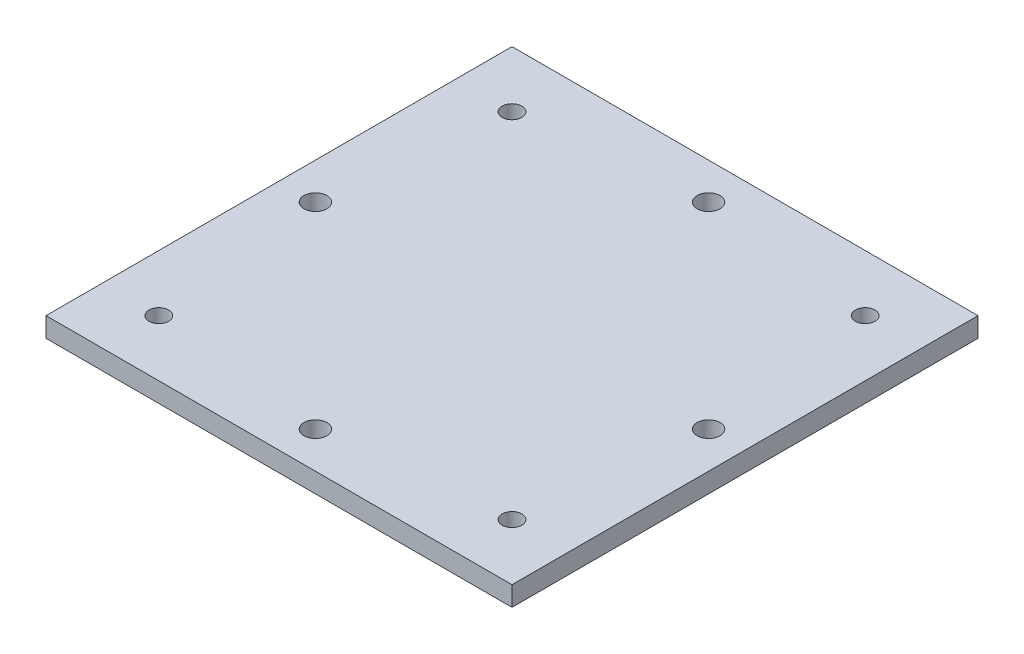
ISO-10303-21;
HEADER;
FILE_DESCRIPTION(('STEP AP214'),'2;1');
FILE_NAME('part.step','',(''),(''),'','','');
FILE_SCHEMA(('AUTOMOTIVE_DESIGN { 1 0 10303 214 1 1 1 1 }'));
ENDSEC;
DATA;
#1=APPLICATION_CONTEXT('core data for automotive mechanical design processes');
#2=APPLICATION_PROTOCOL_DEFINITION('international standard','automotive_design',2000,#1);
#3=PRODUCT_CONTEXT('',#1,'mechanical');
#4=PRODUCT('Part','Part','',(#3));
#5=PRODUCT_RELATED_PRODUCT_CATEGORY('part','',(#4));
#6=PRODUCT_DEFINITION_FORMATION('','',#4);
#7=PRODUCT_DEFINITION_CONTEXT('part definition',#1,'design');
#8=PRODUCT_DEFINITION('design','',#6,#7);
#9=PRODUCT_DEFINITION_SHAPE('','',#8);
#10=(LENGTH_UNIT() NAMED_UNIT(*) SI_UNIT(.MILLI.,.METRE.));
#11=(NAMED_UNIT(*) PLANE_ANGLE_UNIT() SI_UNIT($,.RADIAN.));
#12=(NAMED_UNIT(*) SI_UNIT($,.STERADIAN.) SOLID_ANGLE_UNIT());
#13=UNCERTAINTY_MEASURE_WITH_UNIT(LENGTH_MEASURE(1.E-05),#10,'distance_accuracy_value','');
#14=(GEOMETRIC_REPRESENTATION_CONTEXT(3) GLOBAL_UNCERTAINTY_ASSIGNED_CONTEXT((#13)) GLOBAL_UNIT_ASSIGNED_CONTEXT((#10,
#11,#12)) REPRESENTATION_CONTEXT('',''));
#15=CARTESIAN_POINT('',(0.,0.,0.));
#16=DIRECTION('',(0.,0.,1.));
#17=DIRECTION('',(1.,0.,0.));
#18=AXIS2_PLACEMENT_3D('',#15,#16,#17);
#19=CARTESIAN_POINT('',(0.,3.,0.));
#20=DIRECTION('',(0.,1.,0.));
#21=DIRECTION('',(0.,0.,1.));
#22=AXIS2_PLACEMENT_3D('',#19,#20,#21);
#23=PLANE('',#22);
#24=CARTESIAN_POINT('',(26.9494,3.,26.9494));
#25=DIRECTION('',(0.,1.,0.));
#26=DIRECTION('',(0.,0.,1.));
#27=AXIS2_PLACEMENT_3D('',#24,#25,#26);
#28=CIRCLE('',#27,1.500000048);
#29=CARTESIAN_POINT('',(26.9494,3.,28.449400048));
#30=VERTEX_POINT('',#29);
#31=EDGE_CURVE('E144',#30,#30,#28,.T.);
#32=ORIENTED_EDGE('',*,*,#31,.F.);
#33=EDGE_LOOP('',(#32));
#34=FACE_BOUND('',#33,.T.);
#35=CARTESIAN_POINT('',(0.,3.,30.));
#36=DIRECTION('',(0.,1.,0.));
#37=DIRECTION('',(0.,0.,1.));
#38=AXIS2_PLACEMENT_3D('',#35,#36,#37);
#39=CIRCLE('',#38,1.75259999999999);
#40=CARTESIAN_POINT('',(0.,3.,31.7526));
#41=VERTEX_POINT('',#40);
#42=EDGE_CURVE('E132',#41,#41,#39,.T.);
#43=ORIENTED_EDGE('',*,*,#42,.F.);
#44=EDGE_LOOP('',(#43));
#45=FACE_BOUND('',#44,.T.);
#46=CARTESIAN_POINT('',(-30.,3.,0.));
#47=DIRECTION('',(0.,1.,0.));
#48=DIRECTION('',(0.,0.,1.));
#49=AXIS2_PLACEMENT_3D('',#46,#47,#48);
#50=CIRCLE('',#49,1.75259999999999);
#51=CARTESIAN_POINT('',(-30.,3.,1.75259999999998));
#52=VERTEX_POINT('',#51);
#53=EDGE_CURVE('E120',#52,#52,#50,.T.);
#54=ORIENTED_EDGE('',*,*,#53,.F.);
#55=EDGE_LOOP('',(#54));
#56=FACE_BOUND('',#55,.T.);
#57=CARTESIAN_POINT('',(0.,3.,-30.));
#58=DIRECTION('',(0.,1.,0.));
#59=DIRECTION('',(0.,0.,1.));
#60=AXIS2_PLACEMENT_3D('',#57,#58,#59);
#61=CIRCLE('',#60,1.75259999999999);
#62=CARTESIAN_POINT('',(0.,3.,-28.2474));
#63=VERTEX_POINT('',#62);
#64=EDGE_CURVE('E99',#63,#63,#61,.T.);
#65=ORIENTED_EDGE('',*,*,#64,.F.);
#66=EDGE_LOOP('',(#65));
#67=FACE_BOUND('',#66,.T.);
#68=DIRECTION('',(0.,0.,1.));
#69=VECTOR('',#68,1.);
#70=CARTESIAN_POINT('',(-35.56,3.,35.56));
#71=LINE('',#70,#69);
#72=CARTESIAN_POINT('',(-35.56,3.,-35.56));
#73=VERTEX_POINT('',#72);
#74=CARTESIAN_POINT('',(-35.56,3.,35.56));
#75=VERTEX_POINT('',#74);
#76=EDGE_CURVE('E84',#73,#75,#71,.T.);
#77=ORIENTED_EDGE('',*,*,#76,.T.);
#78=DIRECTION('',(1.,0.,0.));
#79=VECTOR('',#78,1.);
#80=CARTESIAN_POINT('',(35.56,3.,35.56));
#81=LINE('',#80,#79);
#82=CARTESIAN_POINT('',(35.56,3.,35.56));
#83=VERTEX_POINT('',#82);
#84=EDGE_CURVE('E79',#75,#83,#81,.T.);
#85=ORIENTED_EDGE('',*,*,#84,.T.);
#86=DIRECTION('',(0.,0.,-1.));
#87=VECTOR('',#86,1.);
#88=CARTESIAN_POINT('',(35.56,3.,35.56));
#89=LINE('',#88,#87);
#90=CARTESIAN_POINT('',(35.56,3.,-35.56));
#91=VERTEX_POINT('',#90);
#92=EDGE_CURVE('E82',#83,#91,#89,.T.);
#93=ORIENTED_EDGE('',*,*,#92,.T.);
#94=DIRECTION('',(-1.,0.,0.));
#95=VECTOR('',#94,1.);
#96=CARTESIAN_POINT('',(35.56,3.,-35.56));
#97=LINE('',#96,#95);
#98=EDGE_CURVE('E49',#91,#73,#97,.T.);
#99=ORIENTED_EDGE('',*,*,#98,.T.);
#100=EDGE_LOOP('',(#77,#85,#93,#99));
#101=FACE_BOUND('',#100,.T.);
#102=CARTESIAN_POINT('',(26.9494,3.,-26.9494));
#103=DIRECTION('',(0.,1.,0.));
#104=DIRECTION('',(0.,0.,1.));
#105=AXIS2_PLACEMENT_3D('',#102,#103,#104);
#106=CIRCLE('',#105,1.500000048);
#107=CARTESIAN_POINT('',(26.9494,3.,-25.449399952));
#108=VERTEX_POINT('',#107);
#109=EDGE_CURVE('E114',#108,#108,#106,.T.);
#110=ORIENTED_EDGE('',*,*,#109,.F.);
#111=EDGE_LOOP('',(#110));
#112=FACE_BOUND('',#111,.T.);
#113=CARTESIAN_POINT('',(30.,3.,0.));
#114=DIRECTION('',(0.,1.,0.));
#115=DIRECTION('',(0.,0.,1.));
#116=AXIS2_PLACEMENT_3D('',#113,#114,#115);
#117=CIRCLE('',#116,1.75260000000003);
#118=CARTESIAN_POINT('',(30.,3.,1.75260000000002));
#119=VERTEX_POINT('',#118);
#120=EDGE_CURVE('E126',#119,#119,#117,.T.);
#121=ORIENTED_EDGE('',*,*,#120,.F.);
#122=EDGE_LOOP('',(#121));
#123=FACE_BOUND('',#122,.T.);
#124=CARTESIAN_POINT('',(-26.9494,3.,-26.9494));
#125=DIRECTION('',(0.,1.,0.));
#126=DIRECTION('',(0.,0.,1.));
#127=AXIS2_PLACEMENT_3D('',#124,#125,#126);
#128=CIRCLE('',#127,1.500000048);
#129=CARTESIAN_POINT('',(-26.9494,3.,-25.449399952));
#130=VERTEX_POINT('',#129);
#131=EDGE_CURVE('E138',#130,#130,#128,.T.);
#132=ORIENTED_EDGE('',*,*,#131,.F.);
#133=EDGE_LOOP('',(#132));
#134=FACE_BOUND('',#133,.T.);
#135=CARTESIAN_POINT('',(-26.9494,3.,26.9494));
#136=DIRECTION('',(0.,1.,0.));
#137=DIRECTION('',(0.,0.,1.));
#138=AXIS2_PLACEMENT_3D('',#135,#136,#137);
#139=CIRCLE('',#138,1.500000048);
#140=CARTESIAN_POINT('',(-26.9494,3.,28.449400048));
#141=VERTEX_POINT('',#140);
#142=EDGE_CURVE('E150',#141,#141,#139,.T.);
#143=ORIENTED_EDGE('',*,*,#142,.F.);
#144=EDGE_LOOP('',(#143));
#145=FACE_BOUND('',#144,.T.);
#146=ADVANCED_FACE('F32',(#34,#45,#56,#67,#101,#112,#123,#134,#145),#23,.T.);
#147=CARTESIAN_POINT('',(0.,0.,0.));
#148=DIRECTION('',(0.,1.,0.));
#149=DIRECTION('',(0.,0.,1.));
#150=AXIS2_PLACEMENT_3D('',#147,#148,#149);
#151=PLANE('',#150);
#152=DIRECTION('',(0.,0.,1.));
#153=VECTOR('',#152,1.);
#154=CARTESIAN_POINT('',(-35.56,0.,35.56));
#155=LINE('',#154,#153);
#156=CARTESIAN_POINT('',(-35.56,0.,-35.56));
#157=VERTEX_POINT('',#156);
#158=CARTESIAN_POINT('',(-35.56,0.,35.56));
#159=VERTEX_POINT('',#158);
#160=EDGE_CURVE('E96',#157,#159,#155,.T.);
#161=ORIENTED_EDGE('',*,*,#160,.F.);
#162=DIRECTION('',(-1.,0.,0.));
#163=VECTOR('',#162,1.);
#164=CARTESIAN_POINT('',(35.56,0.,-35.56));
#165=LINE('',#164,#163);
#166=CARTESIAN_POINT('',(35.56,0.,-35.56));
#167=VERTEX_POINT('',#166);
#168=EDGE_CURVE('E72',#167,#157,#165,.T.);
#169=ORIENTED_EDGE('',*,*,#168,.F.);
#170=DIRECTION('',(0.,0.,-1.));
#171=VECTOR('',#170,1.);
#172=CARTESIAN_POINT('',(35.56,0.,35.56));
#173=LINE('',#172,#171);
#174=CARTESIAN_POINT('',(35.56,0.,35.56));
#175=VERTEX_POINT('',#174);
#176=EDGE_CURVE('E66',#175,#167,#173,.T.);
#177=ORIENTED_EDGE('',*,*,#176,.F.);
#178=DIRECTION('',(1.,0.,0.));
#179=VECTOR('',#178,1.);
#180=CARTESIAN_POINT('',(35.56,0.,35.56));
#181=LINE('',#180,#179);
#182=EDGE_CURVE('E88',#159,#175,#181,.T.);
#183=ORIENTED_EDGE('',*,*,#182,.F.);
#184=EDGE_LOOP('',(#161,#169,#177,#183));
#185=FACE_BOUND('',#184,.T.);
#186=CARTESIAN_POINT('',(0.,0.,-30.));
#187=DIRECTION('',(0.,1.,0.));
#188=DIRECTION('',(0.,0.,1.));
#189=AXIS2_PLACEMENT_3D('',#186,#187,#188);
#190=CIRCLE('',#189,1.75259999999999);
#191=CARTESIAN_POINT('',(0.,0.,-28.2474));
#192=VERTEX_POINT('',#191);
#193=EDGE_CURVE('E111',#192,#192,#190,.T.);
#194=ORIENTED_EDGE('',*,*,#193,.T.);
#195=EDGE_LOOP('',(#194));
#196=FACE_BOUND('',#195,.T.);
#197=CARTESIAN_POINT('',(26.9494,0.,-26.9494));
#198=DIRECTION('',(0.,1.,0.));
#199=DIRECTION('',(0.,0.,1.));
#200=AXIS2_PLACEMENT_3D('',#197,#198,#199);
#201=CIRCLE('',#200,1.500000048);
#202=CARTESIAN_POINT('',(26.9494,0.,-25.449399952));
#203=VERTEX_POINT('',#202);
#204=EDGE_CURVE('E117',#203,#203,#201,.T.);
#205=ORIENTED_EDGE('',*,*,#204,.T.);
#206=EDGE_LOOP('',(#205));
#207=FACE_BOUND('',#206,.T.);
#208=CARTESIAN_POINT('',(-30.,0.,0.));
#209=DIRECTION('',(0.,1.,0.));
#210=DIRECTION('',(0.,0.,1.));
#211=AXIS2_PLACEMENT_3D('',#208,#209,#210);
#212=CIRCLE('',#211,1.75259999999999);
#213=CARTESIAN_POINT('',(-30.,0.,1.75259999999998));
#214=VERTEX_POINT('',#213);
#215=EDGE_CURVE('E123',#214,#214,#212,.T.);
#216=ORIENTED_EDGE('',*,*,#215,.T.);
#217=EDGE_LOOP('',(#216));
#218=FACE_BOUND('',#217,.T.);
#219=CARTESIAN_POINT('',(30.,0.,0.));
#220=DIRECTION('',(0.,1.,0.));
#221=DIRECTION('',(0.,0.,1.));
#222=AXIS2_PLACEMENT_3D('',#219,#220,#221);
#223=CIRCLE('',#222,1.75260000000003);
#224=CARTESIAN_POINT('',(30.,0.,1.75260000000002));
#225=VERTEX_POINT('',#224);
#226=EDGE_CURVE('E129',#225,#225,#223,.T.);
#227=ORIENTED_EDGE('',*,*,#226,.T.);
#228=EDGE_LOOP('',(#227));
#229=FACE_BOUND('',#228,.T.);
#230=CARTESIAN_POINT('',(0.,0.,30.));
#231=DIRECTION('',(0.,1.,0.));
#232=DIRECTION('',(0.,0.,1.));
#233=AXIS2_PLACEMENT_3D('',#230,#231,#232);
#234=CIRCLE('',#233,1.75259999999999);
#235=CARTESIAN_POINT('',(0.,0.,31.7526));
#236=VERTEX_POINT('',#235);
#237=EDGE_CURVE('E135',#236,#236,#234,.T.);
#238=ORIENTED_EDGE('',*,*,#237,.T.);
#239=EDGE_LOOP('',(#238));
#240=FACE_BOUND('',#239,.T.);
#241=CARTESIAN_POINT('',(-26.9494,0.,-26.9494));
#242=DIRECTION('',(0.,1.,0.));
#243=DIRECTION('',(0.,0.,1.));
#244=AXIS2_PLACEMENT_3D('',#241,#242,#243);
#245=CIRCLE('',#244,1.500000048);
#246=CARTESIAN_POINT('',(-26.9494,0.,-25.449399952));
#247=VERTEX_POINT('',#246);
#248=EDGE_CURVE('E141',#247,#247,#245,.T.);
#249=ORIENTED_EDGE('',*,*,#248,.T.);
#250=EDGE_LOOP('',(#249));
#251=FACE_BOUND('',#250,.T.);
#252=CARTESIAN_POINT('',(26.9494,0.,26.9494));
#253=DIRECTION('',(0.,1.,0.));
#254=DIRECTION('',(0.,0.,1.));
#255=AXIS2_PLACEMENT_3D('',#252,#253,#254);
#256=CIRCLE('',#255,1.500000048);
#257=CARTESIAN_POINT('',(26.9494,0.,28.449400048));
#258=VERTEX_POINT('',#257);
#259=EDGE_CURVE('E147',#258,#258,#256,.T.);
#260=ORIENTED_EDGE('',*,*,#259,.T.);
#261=EDGE_LOOP('',(#260));
#262=FACE_BOUND('',#261,.T.);
#263=CARTESIAN_POINT('',(-26.9494,0.,26.9494));
#264=DIRECTION('',(0.,1.,0.));
#265=DIRECTION('',(0.,0.,1.));
#266=AXIS2_PLACEMENT_3D('',#263,#264,#265);
#267=CIRCLE('',#266,1.500000048);
#268=CARTESIAN_POINT('',(-26.9494,0.,28.449400048));
#269=VERTEX_POINT('',#268);
#270=EDGE_CURVE('E153',#269,#269,#267,.T.);
#271=ORIENTED_EDGE('',*,*,#270,.T.);
#272=EDGE_LOOP('',(#271));
#273=FACE_BOUND('',#272,.T.);
#274=ADVANCED_FACE('F107',(#185,#196,#207,#218,#229,#240,#251,#262,#273),#151,.F.);
#275=CARTESIAN_POINT('',(-35.56,3.,35.56));
#276=DIRECTION('',(1.,0.,0.));
#277=DIRECTION('',(0.,0.,-1.));
#278=AXIS2_PLACEMENT_3D('',#275,#276,#277);
#279=PLANE('',#278);
#280=ORIENTED_EDGE('',*,*,#160,.T.);
#281=DIRECTION('',(0.,-1.,0.));
#282=VECTOR('',#281,1.);
#283=CARTESIAN_POINT('',(-35.56,3.,35.56));
#284=LINE('',#283,#282);
#285=EDGE_CURVE('E11',#75,#159,#284,.T.);
#286=ORIENTED_EDGE('',*,*,#285,.F.);
#287=ORIENTED_EDGE('',*,*,#76,.F.);
#288=DIRECTION('',(0.,-1.,0.));
#289=VECTOR('',#288,1.);
#290=CARTESIAN_POINT('',(-35.56,3.,-35.56));
#291=LINE('',#290,#289);
#292=EDGE_CURVE('E92',#73,#157,#291,.T.);
#293=ORIENTED_EDGE('',*,*,#292,.T.);
#294=EDGE_LOOP('',(#280,#286,#287,#293));
#295=FACE_BOUND('',#294,.T.);
#296=ADVANCED_FACE('F34',(#295),#279,.F.);
#297=CARTESIAN_POINT('',(35.56,3.,35.56));
#298=DIRECTION('',(0.,0.,-1.));
#299=DIRECTION('',(-1.,0.,0.));
#300=AXIS2_PLACEMENT_3D('',#297,#298,#299);
#301=PLANE('',#300);
#302=ORIENTED_EDGE('',*,*,#182,.T.);
#303=DIRECTION('',(0.,-1.,0.));
#304=VECTOR('',#303,1.);
#305=CARTESIAN_POINT('',(35.56,3.,35.56));
#306=LINE('',#305,#304);
#307=EDGE_CURVE('E41',#83,#175,#306,.T.);
#308=ORIENTED_EDGE('',*,*,#307,.F.);
#309=ORIENTED_EDGE('',*,*,#84,.F.);
#310=ORIENTED_EDGE('',*,*,#285,.T.);
#311=EDGE_LOOP('',(#302,#308,#309,#310));
#312=FACE_BOUND('',#311,.T.);
#313=ADVANCED_FACE('F87',(#312),#301,.F.);
#314=CARTESIAN_POINT('',(35.56,3.,35.56));
#315=DIRECTION('',(-1.,0.,0.));
#316=DIRECTION('',(0.,0.,1.));
#317=AXIS2_PLACEMENT_3D('',#314,#315,#316);
#318=PLANE('',#317);
#319=ORIENTED_EDGE('',*,*,#176,.T.);
#320=DIRECTION('',(0.,-1.,0.));
#321=VECTOR('',#320,1.);
#322=CARTESIAN_POINT('',(35.56,3.,-35.56));
#323=LINE('',#322,#321);
#324=EDGE_CURVE('E89',#91,#167,#323,.T.);
#325=ORIENTED_EDGE('',*,*,#324,.F.);
#326=ORIENTED_EDGE('',*,*,#92,.F.);
#327=ORIENTED_EDGE('',*,*,#307,.T.);
#328=EDGE_LOOP('',(#319,#325,#326,#327));
#329=FACE_BOUND('',#328,.T.);
#330=ADVANCED_FACE('F90',(#329),#318,.F.);
#331=CARTESIAN_POINT('',(35.56,3.,-35.56));
#332=DIRECTION('',(0.,0.,1.));
#333=DIRECTION('',(1.,0.,0.));
#334=AXIS2_PLACEMENT_3D('',#331,#332,#333);
#335=PLANE('',#334);
#336=ORIENTED_EDGE('',*,*,#168,.T.);
#337=ORIENTED_EDGE('',*,*,#292,.F.);
#338=ORIENTED_EDGE('',*,*,#98,.F.);
#339=ORIENTED_EDGE('',*,*,#324,.T.);
#340=EDGE_LOOP('',(#336,#337,#338,#339));
#341=FACE_BOUND('',#340,.T.);
#342=ADVANCED_FACE('F104',(#341),#335,.F.);
#343=CARTESIAN_POINT('',(0.,3.,-30.));
#344=DIRECTION('',(0.,-1.,0.));
#345=DIRECTION('',(0.,0.,-1.));
#346=AXIS2_PLACEMENT_3D('',#343,#344,#345);
#347=CYLINDRICAL_SURFACE('',#346,1.75259999999999);
#348=ORIENTED_EDGE('',*,*,#64,.T.);
#349=EDGE_LOOP('',(#348));
#350=FACE_BOUND('',#349,.T.);
#351=ORIENTED_EDGE('',*,*,#193,.F.);
#352=EDGE_LOOP('',(#351));
#353=FACE_BOUND('',#352,.T.);
#354=ADVANCED_FACE('F172',(#350,#353),#347,.F.);
#355=CARTESIAN_POINT('',(26.9494,3.,-26.9494));
#356=DIRECTION('',(0.,-1.,0.));
#357=DIRECTION('',(0.,0.,-1.));
#358=AXIS2_PLACEMENT_3D('',#355,#356,#357);
#359=CYLINDRICAL_SURFACE('',#358,1.500000048);
#360=ORIENTED_EDGE('',*,*,#109,.T.);
#361=EDGE_LOOP('',(#360));
#362=FACE_BOUND('',#361,.T.);
#363=ORIENTED_EDGE('',*,*,#204,.F.);
#364=EDGE_LOOP('',(#363));
#365=FACE_BOUND('',#364,.T.);
#366=ADVANCED_FACE('F218',(#362,#365),#359,.F.);
#367=CARTESIAN_POINT('',(-30.,3.,0.));
#368=DIRECTION('',(0.,-1.,0.));
#369=DIRECTION('',(0.,0.,-1.));
#370=AXIS2_PLACEMENT_3D('',#367,#368,#369);
#371=CYLINDRICAL_SURFACE('',#370,1.75259999999999);
#372=ORIENTED_EDGE('',*,*,#53,.T.);
#373=EDGE_LOOP('',(#372));
#374=FACE_BOUND('',#373,.T.);
#375=ORIENTED_EDGE('',*,*,#215,.F.);
#376=EDGE_LOOP('',(#375));
#377=FACE_BOUND('',#376,.T.);
#378=ADVANCED_FACE('F226',(#374,#377),#371,.F.);
#379=CARTESIAN_POINT('',(30.,3.,0.));
#380=DIRECTION('',(0.,-1.,0.));
#381=DIRECTION('',(0.,0.,-1.));
#382=AXIS2_PLACEMENT_3D('',#379,#380,#381);
#383=CYLINDRICAL_SURFACE('',#382,1.75260000000003);
#384=ORIENTED_EDGE('',*,*,#120,.T.);
#385=EDGE_LOOP('',(#384));
#386=FACE_BOUND('',#385,.T.);
#387=ORIENTED_EDGE('',*,*,#226,.F.);
#388=EDGE_LOOP('',(#387));
#389=FACE_BOUND('',#388,.T.);
#390=ADVANCED_FACE('F234',(#386,#389),#383,.F.);
#391=CARTESIAN_POINT('',(0.,3.,30.));
#392=DIRECTION('',(0.,-1.,0.));
#393=DIRECTION('',(0.,0.,-1.));
#394=AXIS2_PLACEMENT_3D('',#391,#392,#393);
#395=CYLINDRICAL_SURFACE('',#394,1.75259999999999);
#396=ORIENTED_EDGE('',*,*,#42,.T.);
#397=EDGE_LOOP('',(#396));
#398=FACE_BOUND('',#397,.T.);
#399=ORIENTED_EDGE('',*,*,#237,.F.);
#400=EDGE_LOOP('',(#399));
#401=FACE_BOUND('',#400,.T.);
#402=ADVANCED_FACE('F243',(#398,#401),#395,.F.);
#403=CARTESIAN_POINT('',(-26.9494,3.,-26.9494));
#404=DIRECTION('',(0.,-1.,0.));
#405=DIRECTION('',(0.,0.,-1.));
#406=AXIS2_PLACEMENT_3D('',#403,#404,#405);
#407=CYLINDRICAL_SURFACE('',#406,1.500000048);
#408=ORIENTED_EDGE('',*,*,#131,.T.);
#409=EDGE_LOOP('',(#408));
#410=FACE_BOUND('',#409,.T.);
#411=ORIENTED_EDGE('',*,*,#248,.F.);
#412=EDGE_LOOP('',(#411));
#413=FACE_BOUND('',#412,.T.);
#414=ADVANCED_FACE('F252',(#410,#413),#407,.F.);
#415=CARTESIAN_POINT('',(26.9494,3.,26.9494));
#416=DIRECTION('',(0.,-1.,0.));
#417=DIRECTION('',(0.,0.,-1.));
#418=AXIS2_PLACEMENT_3D('',#415,#416,#417);
#419=CYLINDRICAL_SURFACE('',#418,1.500000048);
#420=ORIENTED_EDGE('',*,*,#31,.T.);
#421=EDGE_LOOP('',(#420));
#422=FACE_BOUND('',#421,.T.);
#423=ORIENTED_EDGE('',*,*,#259,.F.);
#424=EDGE_LOOP('',(#423));
#425=FACE_BOUND('',#424,.T.);
#426=ADVANCED_FACE('F261',(#422,#425),#419,.F.);
#427=CARTESIAN_POINT('',(-26.9494,3.,26.9494));
#428=DIRECTION('',(0.,-1.,0.));
#429=DIRECTION('',(0.,0.,-1.));
#430=AXIS2_PLACEMENT_3D('',#427,#428,#429);
#431=CYLINDRICAL_SURFACE('',#430,1.500000048);
#432=ORIENTED_EDGE('',*,*,#142,.T.);
#433=EDGE_LOOP('',(#432));
#434=FACE_BOUND('',#433,.T.);
#435=ORIENTED_EDGE('',*,*,#270,.F.);
#436=EDGE_LOOP('',(#435));
#437=FACE_BOUND('',#436,.T.);
#438=ADVANCED_FACE('F159',(#434,#437),#431,.F.);
#439=CLOSED_SHELL('',(#146,#274,#296,#313,#330,#342,#354,#366,#378,#390,#402,#414,#426,#438));
#440=MANIFOLD_SOLID_BREP('B2',#439);
#441=ADVANCED_BREP_SHAPE_REPRESENTATION('',(#18,#440),#14);
#442=SHAPE_DEFINITION_REPRESENTATION(#9,#441);
ENDSEC;
END-ISO-10303-21;
